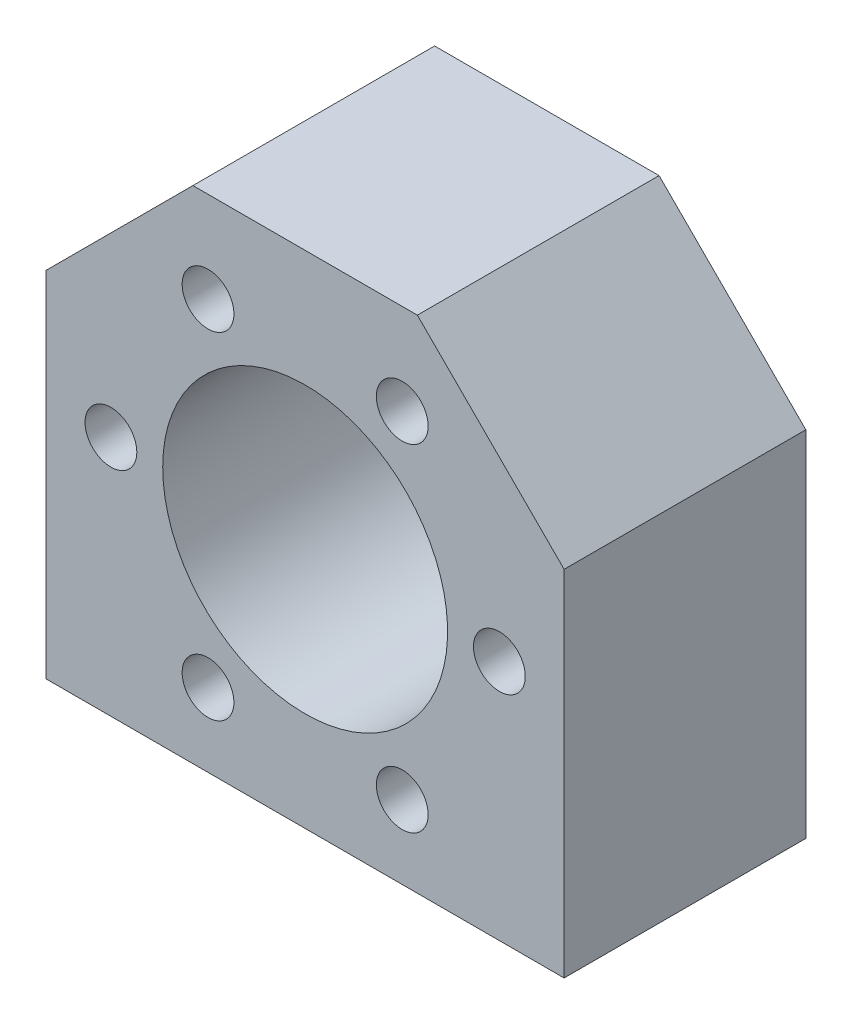
ISO-10303-21;
HEADER;
FILE_DESCRIPTION(('STEP AP214'),'2;1');
FILE_NAME('part.step','',(''),(''),'','','');
FILE_SCHEMA(('AUTOMOTIVE_DESIGN { 1 0 10303 214 1 1 1 1 }'));
ENDSEC;
DATA;
#1=APPLICATION_CONTEXT('core data for automotive mechanical design processes');
#2=APPLICATION_PROTOCOL_DEFINITION('international standard','automotive_design',2000,#1);
#3=PRODUCT_CONTEXT('',#1,'mechanical');
#4=PRODUCT('Part','Part','',(#3));
#5=PRODUCT_RELATED_PRODUCT_CATEGORY('part','',(#4));
#6=PRODUCT_DEFINITION_FORMATION('','',#4);
#7=PRODUCT_DEFINITION_CONTEXT('part definition',#1,'design');
#8=PRODUCT_DEFINITION('design','',#6,#7);
#9=PRODUCT_DEFINITION_SHAPE('','',#8);
#10=(LENGTH_UNIT() NAMED_UNIT(*) SI_UNIT(.MILLI.,.METRE.));
#11=(NAMED_UNIT(*) PLANE_ANGLE_UNIT() SI_UNIT($,.RADIAN.));
#12=(NAMED_UNIT(*) SI_UNIT($,.STERADIAN.) SOLID_ANGLE_UNIT());
#13=UNCERTAINTY_MEASURE_WITH_UNIT(LENGTH_MEASURE(1.E-05),#10,'distance_accuracy_value','');
#14=(GEOMETRIC_REPRESENTATION_CONTEXT(3) GLOBAL_UNCERTAINTY_ASSIGNED_CONTEXT((#13)) GLOBAL_UNIT_ASSIGNED_CONTEXT((#10,
#11,#12)) REPRESENTATION_CONTEXT('',''));
#15=CARTESIAN_POINT('',(0.,0.,0.));
#16=DIRECTION('',(0.,0.,1.));
#17=DIRECTION('',(1.,0.,0.));
#18=AXIS2_PLACEMENT_3D('',#15,#16,#17);
#19=CARTESIAN_POINT('',(41.1066648374422,-36.4016686785176,28.));
#20=DIRECTION('',(0.,1.,0.));
#21=DIRECTION('',(0.,0.,1.));
#22=AXIS2_PLACEMENT_3D('',#19,#20,#21);
#23=PLANE('',#22);
#24=CARTESIAN_POINT('',(-10.8933351625578,-36.4016686785176,14.));
#25=DIRECTION('',(0.,-1.,0.));
#26=DIRECTION('',(0.,0.,-1.));
#27=AXIS2_PLACEMENT_3D('',#24,#25,#26);
#28=CIRCLE('',#27,4.);
#29=CARTESIAN_POINT('',(-10.8933351625578,-36.4016686785176,10.));
#30=VERTEX_POINT('',#29);
#31=EDGE_CURVE('E163',#30,#30,#28,.T.);
#32=ORIENTED_EDGE('',*,*,#31,.F.);
#33=EDGE_LOOP('',(#32));
#34=FACE_BOUND('',#33,.T.);
#35=CARTESIAN_POINT('',(33.1066648374422,-36.4016686785176,14.));
#36=DIRECTION('',(0.,-1.,0.));
#37=DIRECTION('',(0.,0.,-1.));
#38=AXIS2_PLACEMENT_3D('',#35,#36,#37);
#39=CIRCLE('',#38,4.00000000000001);
#40=CARTESIAN_POINT('',(33.1066648374422,-36.4016686785176,9.99999999999999));
#41=VERTEX_POINT('',#40);
#42=EDGE_CURVE('E166',#41,#41,#39,.T.);
#43=ORIENTED_EDGE('',*,*,#42,.F.);
#44=EDGE_LOOP('',(#43));
#45=FACE_BOUND('',#44,.T.);
#46=DIRECTION('',(1.,0.,0.));
#47=VECTOR('',#46,1.);
#48=CARTESIAN_POINT('',(41.1066648374422,-36.4016686785176,0.));
#49=LINE('',#48,#47);
#50=CARTESIAN_POINT('',(-18.8933351625578,-36.4016686785176,0.));
#51=VERTEX_POINT('',#50);
#52=CARTESIAN_POINT('',(41.1066648374422,-36.4016686785176,0.));
#53=VERTEX_POINT('',#52);
#54=EDGE_CURVE('E117',#51,#53,#49,.T.);
#55=ORIENTED_EDGE('',*,*,#54,.T.);
#56=DIRECTION('',(0.,0.,-1.));
#57=VECTOR('',#56,1.);
#58=CARTESIAN_POINT('',(41.1066648374422,-36.4016686785176,28.));
#59=LINE('',#58,#57);
#60=CARTESIAN_POINT('',(41.1066648374422,-36.4016686785176,28.));
#61=VERTEX_POINT('',#60);
#62=EDGE_CURVE('E11',#61,#53,#59,.T.);
#63=ORIENTED_EDGE('',*,*,#62,.F.);
#64=DIRECTION('',(1.,0.,0.));
#65=VECTOR('',#64,1.);
#66=CARTESIAN_POINT('',(41.1066648374422,-36.4016686785176,28.));
#67=LINE('',#66,#65);
#68=CARTESIAN_POINT('',(-18.8933351625578,-36.4016686785176,28.));
#69=VERTEX_POINT('',#68);
#70=EDGE_CURVE('E128',#69,#61,#67,.T.);
#71=ORIENTED_EDGE('',*,*,#70,.F.);
#72=DIRECTION('',(0.,0.,-1.));
#73=VECTOR('',#72,1.);
#74=CARTESIAN_POINT('',(-18.8933351625578,-36.4016686785176,28.));
#75=LINE('',#74,#73);
#76=EDGE_CURVE('E113',#69,#51,#75,.T.);
#77=ORIENTED_EDGE('',*,*,#76,.T.);
#78=EDGE_LOOP('',(#55,#63,#71,#77));
#79=FACE_BOUND('',#78,.T.);
#80=ADVANCED_FACE('F33',(#34,#45,#79),#23,.F.);
#81=CARTESIAN_POINT('',(41.1066648374422,4.59833132148261,28.));
#82=DIRECTION('',(-1.,0.,0.));
#83=DIRECTION('',(0.,0.,1.));
#84=AXIS2_PLACEMENT_3D('',#81,#82,#83);
#85=PLANE('',#84);
#86=DIRECTION('',(0.,1.,0.));
#87=VECTOR('',#86,1.);
#88=CARTESIAN_POINT('',(41.1066648374422,4.59833132148261,0.));
#89=LINE('',#88,#87);
#90=CARTESIAN_POINT('',(41.1066648374422,4.59833132148261,0.));
#91=VERTEX_POINT('',#90);
#92=EDGE_CURVE('E120',#53,#91,#89,.T.);
#93=ORIENTED_EDGE('',*,*,#92,.T.);
#94=DIRECTION('',(0.,0.,-1.));
#95=VECTOR('',#94,1.);
#96=CARTESIAN_POINT('',(41.1066648374422,4.59833132148261,28.));
#97=LINE('',#96,#95);
#98=CARTESIAN_POINT('',(41.1066648374422,4.59833132148261,28.));
#99=VERTEX_POINT('',#98);
#100=EDGE_CURVE('E41',#99,#91,#97,.T.);
#101=ORIENTED_EDGE('',*,*,#100,.F.);
#102=DIRECTION('',(0.,1.,0.));
#103=VECTOR('',#102,1.);
#104=CARTESIAN_POINT('',(41.1066648374422,4.59833132148261,28.));
#105=LINE('',#104,#103);
#106=EDGE_CURVE('E86',#61,#99,#105,.T.);
#107=ORIENTED_EDGE('',*,*,#106,.F.);
#108=ORIENTED_EDGE('',*,*,#62,.T.);
#109=EDGE_LOOP('',(#93,#101,#107,#108));
#110=FACE_BOUND('',#109,.T.);
#111=ADVANCED_FACE('F153',(#110),#85,.F.);
#112=CARTESIAN_POINT('',(24.1066648374422,21.5983313214826,28.));
#113=DIRECTION('',(-0.707106781186548,-0.707106781186547,0.));
#114=DIRECTION('',(0.707106781186547,-0.707106781186548,0.));
#115=AXIS2_PLACEMENT_3D('',#112,#113,#114);
#116=PLANE('',#115);
#117=DIRECTION('',(-0.707106781186547,0.707106781186548,0.));
#118=VECTOR('',#117,1.);
#119=CARTESIAN_POINT('',(24.1066648374422,21.5983313214826,0.));
#120=LINE('',#119,#118);
#121=CARTESIAN_POINT('',(24.1066648374422,21.5983313214826,0.));
#122=VERTEX_POINT('',#121);
#123=EDGE_CURVE('E123',#91,#122,#120,.T.);
#124=ORIENTED_EDGE('',*,*,#123,.T.);
#125=DIRECTION('',(0.,0.,-1.));
#126=VECTOR('',#125,1.);
#127=CARTESIAN_POINT('',(24.1066648374422,21.5983313214826,28.));
#128=LINE('',#127,#126);
#129=CARTESIAN_POINT('',(24.1066648374422,21.5983313214826,28.));
#130=VERTEX_POINT('',#129);
#131=EDGE_CURVE('E108',#130,#122,#128,.T.);
#132=ORIENTED_EDGE('',*,*,#131,.F.);
#133=DIRECTION('',(-0.707106781186547,0.707106781186548,0.));
#134=VECTOR('',#133,1.);
#135=CARTESIAN_POINT('',(24.1066648374422,21.5983313214826,28.));
#136=LINE('',#135,#134);
#137=EDGE_CURVE('E99',#99,#130,#136,.T.);
#138=ORIENTED_EDGE('',*,*,#137,.F.);
#139=ORIENTED_EDGE('',*,*,#100,.T.);
#140=EDGE_LOOP('',(#124,#132,#138,#139));
#141=FACE_BOUND('',#140,.T.);
#142=ADVANCED_FACE('F134',(#141),#116,.F.);
#143=CARTESIAN_POINT('',(-1.89333516255775,21.5983313214826,28.));
#144=DIRECTION('',(0.,-1.,0.));
#145=DIRECTION('',(0.,0.,-1.));
#146=AXIS2_PLACEMENT_3D('',#143,#144,#145);
#147=PLANE('',#146);
#148=DIRECTION('',(-1.,0.,0.));
#149=VECTOR('',#148,1.);
#150=CARTESIAN_POINT('',(-1.89333516255775,21.5983313214826,0.));
#151=LINE('',#150,#149);
#152=CARTESIAN_POINT('',(-1.89333516255775,21.5983313214826,0.));
#153=VERTEX_POINT('',#152);
#154=EDGE_CURVE('E107',#122,#153,#151,.T.);
#155=ORIENTED_EDGE('',*,*,#154,.T.);
#156=DIRECTION('',(0.,0.,-1.));
#157=VECTOR('',#156,1.);
#158=CARTESIAN_POINT('',(-1.89333516255775,21.5983313214826,28.));
#159=LINE('',#158,#157);
#160=CARTESIAN_POINT('',(-1.89333516255775,21.5983313214826,28.));
#161=VERTEX_POINT('',#160);
#162=EDGE_CURVE('E104',#161,#153,#159,.T.);
#163=ORIENTED_EDGE('',*,*,#162,.F.);
#164=DIRECTION('',(-1.,0.,0.));
#165=VECTOR('',#164,1.);
#166=CARTESIAN_POINT('',(-1.89333516255775,21.5983313214826,28.));
#167=LINE('',#166,#165);
#168=EDGE_CURVE('E93',#130,#161,#167,.T.);
#169=ORIENTED_EDGE('',*,*,#168,.F.);
#170=ORIENTED_EDGE('',*,*,#131,.T.);
#171=EDGE_LOOP('',(#155,#163,#169,#170));
#172=FACE_BOUND('',#171,.T.);
#173=ADVANCED_FACE('F105',(#172),#147,.F.);
#174=CARTESIAN_POINT('',(-18.8933351625578,4.59833132148261,28.));
#175=DIRECTION('',(0.707106781186547,-0.707106781186548,0.));
#176=DIRECTION('',(0.707106781186548,0.707106781186547,0.));
#177=AXIS2_PLACEMENT_3D('',#174,#175,#176);
#178=PLANE('',#177);
#179=DIRECTION('',(-0.707106781186548,-0.707106781186547,0.));
#180=VECTOR('',#179,1.);
#181=CARTESIAN_POINT('',(-18.8933351625578,4.59833132148261,0.));
#182=LINE('',#181,#180);
#183=CARTESIAN_POINT('',(-18.8933351625578,4.59833132148261,0.));
#184=VERTEX_POINT('',#183);
#185=EDGE_CURVE('E72',#153,#184,#182,.T.);
#186=ORIENTED_EDGE('',*,*,#185,.T.);
#187=DIRECTION('',(0.,0.,-1.));
#188=VECTOR('',#187,1.);
#189=CARTESIAN_POINT('',(-18.8933351625578,4.59833132148261,28.));
#190=LINE('',#189,#188);
#191=CARTESIAN_POINT('',(-18.8933351625578,4.59833132148261,28.));
#192=VERTEX_POINT('',#191);
#193=EDGE_CURVE('E109',#192,#184,#190,.T.);
#194=ORIENTED_EDGE('',*,*,#193,.F.);
#195=DIRECTION('',(-0.707106781186548,-0.707106781186547,0.));
#196=VECTOR('',#195,1.);
#197=CARTESIAN_POINT('',(-18.8933351625578,4.59833132148261,28.));
#198=LINE('',#197,#196);
#199=EDGE_CURVE('E97',#161,#192,#198,.T.);
#200=ORIENTED_EDGE('',*,*,#199,.F.);
#201=ORIENTED_EDGE('',*,*,#162,.T.);
#202=EDGE_LOOP('',(#186,#194,#200,#201));
#203=FACE_BOUND('',#202,.T.);
#204=ADVANCED_FACE('F111',(#203),#178,.F.);
#205=CARTESIAN_POINT('',(-18.8933351625578,-36.4016686785176,28.));
#206=DIRECTION('',(1.,0.,0.));
#207=DIRECTION('',(0.,0.,-1.));
#208=AXIS2_PLACEMENT_3D('',#205,#206,#207);
#209=PLANE('',#208);
#210=DIRECTION('',(0.,-1.,0.));
#211=VECTOR('',#210,1.);
#212=CARTESIAN_POINT('',(-18.8933351625578,-36.4016686785176,0.));
#213=LINE('',#212,#211);
#214=EDGE_CURVE('E78',#184,#51,#213,.T.);
#215=ORIENTED_EDGE('',*,*,#214,.T.);
#216=ORIENTED_EDGE('',*,*,#76,.F.);
#217=DIRECTION('',(0.,-1.,0.));
#218=VECTOR('',#217,1.);
#219=CARTESIAN_POINT('',(-18.8933351625578,-36.4016686785176,28.));
#220=LINE('',#219,#218);
#221=EDGE_CURVE('E49',#192,#69,#220,.T.);
#222=ORIENTED_EDGE('',*,*,#221,.F.);
#223=ORIENTED_EDGE('',*,*,#193,.T.);
#224=EDGE_LOOP('',(#215,#216,#222,#223));
#225=FACE_BOUND('',#224,.T.);
#226=ADVANCED_FACE('F141',(#225),#209,.F.);
#227=CARTESIAN_POINT('',(0.,0.,28.));
#228=DIRECTION('',(0.,0.,-1.));
#229=DIRECTION('',(-1.,0.,0.));
#230=AXIS2_PLACEMENT_3D('',#227,#228,#229);
#231=PLANE('',#230);
#232=CARTESIAN_POINT('',(22.3566648374424,-27.8872402636674,28.));
#233=DIRECTION('',(0.,0.,-1.));
#234=DIRECTION('',(-0.500000000000007,0.866025403784435,0.));
#235=AXIS2_PLACEMENT_3D('',#232,#233,#234);
#236=CIRCLE('',#235,3.);
#237=CARTESIAN_POINT('',(20.8566648374424,-25.2891640523141,28.));
#238=VERTEX_POINT('',#237);
#239=EDGE_CURVE('E193',#238,#238,#236,.T.);
#240=ORIENTED_EDGE('',*,*,#239,.T.);
#241=EDGE_LOOP('',(#240));
#242=FACE_BOUND('',#241,.T.);
#243=CARTESIAN_POINT('',(-0.143335162557646,-27.8872402636675,28.));
#244=DIRECTION('',(0.,0.,-1.));
#245=DIRECTION('',(0.499999999999994,0.866025403784442,0.));
#246=AXIS2_PLACEMENT_3D('',#243,#244,#245);
#247=CIRCLE('',#246,3.);
#248=CARTESIAN_POINT('',(1.35666483744234,-25.2891640523142,28.));
#249=VERTEX_POINT('',#248);
#250=EDGE_CURVE('E187',#249,#249,#247,.T.);
#251=ORIENTED_EDGE('',*,*,#250,.T.);
#252=EDGE_LOOP('',(#251));
#253=FACE_BOUND('',#252,.T.);
#254=CARTESIAN_POINT('',(-11.3933351625578,-8.4016686785177,28.));
#255=DIRECTION('',(0.,0.,-1.));
#256=DIRECTION('',(1.,0.,0.));
#257=AXIS2_PLACEMENT_3D('',#254,#255,#256);
#258=CIRCLE('',#257,3.);
#259=CARTESIAN_POINT('',(-8.39333516255777,-8.40166867851769,28.));
#260=VERTEX_POINT('',#259);
#261=EDGE_CURVE('E181',#260,#260,#258,.T.);
#262=ORIENTED_EDGE('',*,*,#261,.T.);
#263=EDGE_LOOP('',(#262));
#264=FACE_BOUND('',#263,.T.);
#265=CARTESIAN_POINT('',(-0.14333516255784,11.0839029066323,28.));
#266=DIRECTION('',(0.,0.,-1.));
#267=DIRECTION('',(0.500000000000003,-0.866025403784437,0.));
#268=AXIS2_PLACEMENT_3D('',#265,#266,#267);
#269=CIRCLE('',#268,3.);
#270=CARTESIAN_POINT('',(1.35666483744217,8.48582669527894,28.));
#271=VERTEX_POINT('',#270);
#272=EDGE_CURVE('E174',#271,#271,#269,.T.);
#273=ORIENTED_EDGE('',*,*,#272,.T.);
#274=EDGE_LOOP('',(#273));
#275=FACE_BOUND('',#274,.T.);
#276=CARTESIAN_POINT('',(22.3566648374422,11.0839029066323,28.));
#277=DIRECTION('',(0.,0.,-1.));
#278=DIRECTION('',(-0.499999999999999,-0.866025403784439,0.));
#279=AXIS2_PLACEMENT_3D('',#276,#277,#278);
#280=CIRCLE('',#279,3.);
#281=CARTESIAN_POINT('',(20.8566648374422,8.48582669527899,28.));
#282=VERTEX_POINT('',#281);
#283=EDGE_CURVE('E200',#282,#282,#280,.T.);
#284=ORIENTED_EDGE('',*,*,#283,.T.);
#285=EDGE_LOOP('',(#284));
#286=FACE_BOUND('',#285,.T.);
#287=CARTESIAN_POINT('',(33.6066648374422,-8.40166867851758,28.));
#288=DIRECTION('',(0.,0.,-1.));
#289=DIRECTION('',(-1.,0.,0.));
#290=AXIS2_PLACEMENT_3D('',#287,#288,#289);
#291=CIRCLE('',#290,3.);
#292=CARTESIAN_POINT('',(30.6066648374422,-8.40166867851758,28.));
#293=VERTEX_POINT('',#292);
#294=EDGE_CURVE('E206',#293,#293,#291,.T.);
#295=ORIENTED_EDGE('',*,*,#294,.T.);
#296=EDGE_LOOP('',(#295));
#297=FACE_BOUND('',#296,.T.);
#298=CARTESIAN_POINT('',(11.1066648374422,-8.40166867851758,28.));
#299=DIRECTION('',(0.,0.,-1.));
#300=DIRECTION('',(-1.,0.,0.));
#301=AXIS2_PLACEMENT_3D('',#298,#299,#300);
#302=CIRCLE('',#301,16.5);
#303=CARTESIAN_POINT('',(-5.39333516255777,-8.40166867851758,28.));
#304=VERTEX_POINT('',#303);
#305=EDGE_CURVE('E121',#304,#304,#302,.T.);
#306=ORIENTED_EDGE('',*,*,#305,.T.);
#307=EDGE_LOOP('',(#306));
#308=FACE_BOUND('',#307,.T.);
#309=ORIENTED_EDGE('',*,*,#70,.T.);
#310=ORIENTED_EDGE('',*,*,#106,.T.);
#311=ORIENTED_EDGE('',*,*,#137,.T.);
#312=ORIENTED_EDGE('',*,*,#168,.T.);
#313=ORIENTED_EDGE('',*,*,#199,.T.);
#314=ORIENTED_EDGE('',*,*,#221,.T.);
#315=EDGE_LOOP('',(#309,#310,#311,#312,#313,#314));
#316=FACE_BOUND('',#315,.T.);
#317=ADVANCED_FACE('F95',(#242,#253,#264,#275,#286,#297,#308,#316),#231,.F.);
#318=CARTESIAN_POINT('',(0.,0.,0.));
#319=DIRECTION('',(0.,0.,-1.));
#320=DIRECTION('',(-1.,0.,0.));
#321=AXIS2_PLACEMENT_3D('',#318,#319,#320);
#322=PLANE('',#321);
#323=CARTESIAN_POINT('',(22.3566648374424,-27.8872402636674,0.));
#324=DIRECTION('',(0.,0.,-1.));
#325=DIRECTION('',(-0.500000000000007,0.866025403784435,0.));
#326=AXIS2_PLACEMENT_3D('',#323,#324,#325);
#327=CIRCLE('',#326,3.);
#328=CARTESIAN_POINT('',(20.8566648374424,-25.2891640523141,0.));
#329=VERTEX_POINT('',#328);
#330=EDGE_CURVE('E196',#329,#329,#327,.T.);
#331=ORIENTED_EDGE('',*,*,#330,.F.);
#332=EDGE_LOOP('',(#331));
#333=FACE_BOUND('',#332,.T.);
#334=CARTESIAN_POINT('',(-0.143335162557646,-27.8872402636675,0.));
#335=DIRECTION('',(0.,0.,-1.));
#336=DIRECTION('',(0.499999999999994,0.866025403784442,0.));
#337=AXIS2_PLACEMENT_3D('',#334,#335,#336);
#338=CIRCLE('',#337,3.);
#339=CARTESIAN_POINT('',(1.35666483744234,-25.2891640523142,0.));
#340=VERTEX_POINT('',#339);
#341=EDGE_CURVE('E190',#340,#340,#338,.T.);
#342=ORIENTED_EDGE('',*,*,#341,.F.);
#343=EDGE_LOOP('',(#342));
#344=FACE_BOUND('',#343,.T.);
#345=CARTESIAN_POINT('',(-11.3933351625578,-8.4016686785177,0.));
#346=DIRECTION('',(0.,0.,-1.));
#347=DIRECTION('',(1.,0.,0.));
#348=AXIS2_PLACEMENT_3D('',#345,#346,#347);
#349=CIRCLE('',#348,3.);
#350=CARTESIAN_POINT('',(-8.39333516255777,-8.40166867851769,0.));
#351=VERTEX_POINT('',#350);
#352=EDGE_CURVE('E184',#351,#351,#349,.T.);
#353=ORIENTED_EDGE('',*,*,#352,.F.);
#354=EDGE_LOOP('',(#353));
#355=FACE_BOUND('',#354,.T.);
#356=CARTESIAN_POINT('',(-0.14333516255784,11.0839029066323,0.));
#357=DIRECTION('',(0.,0.,-1.));
#358=DIRECTION('',(0.500000000000003,-0.866025403784437,0.));
#359=AXIS2_PLACEMENT_3D('',#356,#357,#358);
#360=CIRCLE('',#359,3.);
#361=CARTESIAN_POINT('',(1.35666483744217,8.48582669527894,0.));
#362=VERTEX_POINT('',#361);
#363=EDGE_CURVE('E178',#362,#362,#360,.T.);
#364=ORIENTED_EDGE('',*,*,#363,.F.);
#365=EDGE_LOOP('',(#364));
#366=FACE_BOUND('',#365,.T.);
#367=CARTESIAN_POINT('',(22.3566648374422,11.0839029066323,0.));
#368=DIRECTION('',(0.,0.,-1.));
#369=DIRECTION('',(-0.499999999999999,-0.866025403784439,0.));
#370=AXIS2_PLACEMENT_3D('',#367,#368,#369);
#371=CIRCLE('',#370,3.);
#372=CARTESIAN_POINT('',(20.8566648374422,8.48582669527899,0.));
#373=VERTEX_POINT('',#372);
#374=EDGE_CURVE('E177',#373,#373,#371,.T.);
#375=ORIENTED_EDGE('',*,*,#374,.F.);
#376=EDGE_LOOP('',(#375));
#377=FACE_BOUND('',#376,.T.);
#378=CARTESIAN_POINT('',(33.6066648374422,-8.40166867851758,0.));
#379=DIRECTION('',(0.,0.,-1.));
#380=DIRECTION('',(-1.,0.,0.));
#381=AXIS2_PLACEMENT_3D('',#378,#379,#380);
#382=CIRCLE('',#381,3.);
#383=CARTESIAN_POINT('',(30.6066648374422,-8.40166867851758,0.));
#384=VERTEX_POINT('',#383);
#385=EDGE_CURVE('E203',#384,#384,#382,.T.);
#386=ORIENTED_EDGE('',*,*,#385,.F.);
#387=EDGE_LOOP('',(#386));
#388=FACE_BOUND('',#387,.T.);
#389=CARTESIAN_POINT('',(11.1066648374422,-8.40166867851758,0.));
#390=DIRECTION('',(0.,0.,-1.));
#391=DIRECTION('',(-1.,0.,0.));
#392=AXIS2_PLACEMENT_3D('',#389,#390,#391);
#393=CIRCLE('',#392,16.5);
#394=CARTESIAN_POINT('',(-5.39333516255777,-8.40166867851758,0.));
#395=VERTEX_POINT('',#394);
#396=EDGE_CURVE('E209',#395,#395,#393,.T.);
#397=ORIENTED_EDGE('',*,*,#396,.F.);
#398=EDGE_LOOP('',(#397));
#399=FACE_BOUND('',#398,.T.);
#400=ORIENTED_EDGE('',*,*,#54,.F.);
#401=ORIENTED_EDGE('',*,*,#214,.F.);
#402=ORIENTED_EDGE('',*,*,#185,.F.);
#403=ORIENTED_EDGE('',*,*,#154,.F.);
#404=ORIENTED_EDGE('',*,*,#123,.F.);
#405=ORIENTED_EDGE('',*,*,#92,.F.);
#406=EDGE_LOOP('',(#400,#401,#402,#403,#404,#405));
#407=FACE_BOUND('',#406,.T.);
#408=ADVANCED_FACE('F137',(#333,#344,#355,#366,#377,#388,#399,#407),#322,.T.);
#409=CARTESIAN_POINT('',(11.1066648374422,-8.40166867851758,28.));
#410=DIRECTION('',(0.,0.,-1.));
#411=DIRECTION('',(-1.,0.,0.));
#412=AXIS2_PLACEMENT_3D('',#409,#410,#411);
#413=CYLINDRICAL_SURFACE('',#412,16.5);
#414=ORIENTED_EDGE('',*,*,#305,.F.);
#415=EDGE_LOOP('',(#414));
#416=FACE_BOUND('',#415,.T.);
#417=ORIENTED_EDGE('',*,*,#396,.T.);
#418=EDGE_LOOP('',(#417));
#419=FACE_BOUND('',#418,.T.);
#420=ADVANCED_FACE('F219',(#416,#419),#413,.F.);
#421=CARTESIAN_POINT('',(33.6066648374422,-8.40166867851758,28.));
#422=DIRECTION('',(0.,0.,-1.));
#423=DIRECTION('',(-1.,0.,0.));
#424=AXIS2_PLACEMENT_3D('',#421,#422,#423);
#425=CYLINDRICAL_SURFACE('',#424,3.);
#426=ORIENTED_EDGE('',*,*,#294,.F.);
#427=EDGE_LOOP('',(#426));
#428=FACE_BOUND('',#427,.T.);
#429=ORIENTED_EDGE('',*,*,#385,.T.);
#430=EDGE_LOOP('',(#429));
#431=FACE_BOUND('',#430,.T.);
#432=ADVANCED_FACE('F226',(#428,#431),#425,.F.);
#433=CARTESIAN_POINT('',(22.3566648374422,11.0839029066323,28.));
#434=DIRECTION('',(0.,0.,-1.));
#435=DIRECTION('',(-1.,0.,0.));
#436=AXIS2_PLACEMENT_3D('',#433,#434,#435);
#437=CYLINDRICAL_SURFACE('',#436,3.);
#438=ORIENTED_EDGE('',*,*,#283,.F.);
#439=EDGE_LOOP('',(#438));
#440=FACE_BOUND('',#439,.T.);
#441=ORIENTED_EDGE('',*,*,#374,.T.);
#442=EDGE_LOOP('',(#441));
#443=FACE_BOUND('',#442,.T.);
#444=ADVANCED_FACE('F234',(#440,#443),#437,.F.);
#445=CARTESIAN_POINT('',(-0.14333516255784,11.0839029066323,28.));
#446=DIRECTION('',(0.,0.,-1.));
#447=DIRECTION('',(-1.,0.,0.));
#448=AXIS2_PLACEMENT_3D('',#445,#446,#447);
#449=CYLINDRICAL_SURFACE('',#448,3.);
#450=ORIENTED_EDGE('',*,*,#272,.F.);
#451=EDGE_LOOP('',(#450));
#452=FACE_BOUND('',#451,.T.);
#453=ORIENTED_EDGE('',*,*,#363,.T.);
#454=EDGE_LOOP('',(#453));
#455=FACE_BOUND('',#454,.T.);
#456=ADVANCED_FACE('F238',(#452,#455),#449,.F.);
#457=CARTESIAN_POINT('',(-11.3933351625578,-8.4016686785177,28.));
#458=DIRECTION('',(0.,0.,-1.));
#459=DIRECTION('',(-1.,0.,0.));
#460=AXIS2_PLACEMENT_3D('',#457,#458,#459);
#461=CYLINDRICAL_SURFACE('',#460,3.);
#462=ORIENTED_EDGE('',*,*,#261,.F.);
#463=EDGE_LOOP('',(#462));
#464=FACE_BOUND('',#463,.T.);
#465=ORIENTED_EDGE('',*,*,#352,.T.);
#466=EDGE_LOOP('',(#465));
#467=FACE_BOUND('',#466,.T.);
#468=ADVANCED_FACE('F248',(#464,#467),#461,.F.);
#469=CARTESIAN_POINT('',(-0.143335162557646,-27.8872402636675,28.));
#470=DIRECTION('',(0.,0.,-1.));
#471=DIRECTION('',(-1.,0.,0.));
#472=AXIS2_PLACEMENT_3D('',#469,#470,#471);
#473=CYLINDRICAL_SURFACE('',#472,3.);
#474=ORIENTED_EDGE('',*,*,#250,.F.);
#475=EDGE_LOOP('',(#474));
#476=FACE_BOUND('',#475,.T.);
#477=ORIENTED_EDGE('',*,*,#341,.T.);
#478=EDGE_LOOP('',(#477));
#479=FACE_BOUND('',#478,.T.);
#480=ADVANCED_FACE('F244',(#476,#479),#473,.F.);
#481=CARTESIAN_POINT('',(22.3566648374424,-27.8872402636674,28.));
#482=DIRECTION('',(0.,0.,-1.));
#483=DIRECTION('',(-1.,0.,0.));
#484=AXIS2_PLACEMENT_3D('',#481,#482,#483);
#485=CYLINDRICAL_SURFACE('',#484,3.);
#486=ORIENTED_EDGE('',*,*,#239,.F.);
#487=EDGE_LOOP('',(#486));
#488=FACE_BOUND('',#487,.T.);
#489=ORIENTED_EDGE('',*,*,#330,.T.);
#490=EDGE_LOOP('',(#489));
#491=FACE_BOUND('',#490,.T.);
#492=ADVANCED_FACE('F240',(#488,#491),#485,.F.);
#493=CARTESIAN_POINT('',(33.1066648374422,-16.4016686785176,14.));
#494=DIRECTION('',(0.,-1.,0.));
#495=DIRECTION('',(0.,0.,-1.));
#496=AXIS2_PLACEMENT_3D('',#493,#494,#495);
#497=CYLINDRICAL_SURFACE('',#496,4.00000000000001);
#498=CARTESIAN_POINT('',(33.1066648374422,-16.4016686785176,14.));
#499=DIRECTION('',(0.,-1.,0.));
#500=DIRECTION('',(0.,0.,-1.));
#501=AXIS2_PLACEMENT_3D('',#498,#499,#500);
#502=CIRCLE('',#501,4.00000000000001);
#503=CARTESIAN_POINT('',(33.1066648374422,-16.4016686785176,9.99999999999999));
#504=VERTEX_POINT('',#503);
#505=EDGE_CURVE('E168',#504,#504,#502,.T.);
#506=ORIENTED_EDGE('',*,*,#505,.F.);
#507=EDGE_LOOP('',(#506));
#508=FACE_BOUND('',#507,.T.);
#509=ORIENTED_EDGE('',*,*,#42,.T.);
#510=EDGE_LOOP('',(#509));
#511=FACE_BOUND('',#510,.T.);
#512=ADVANCED_FACE('F243',(#508,#511),#497,.F.);
#513=CARTESIAN_POINT('',(33.1066648374422,-16.4016686785176,14.));
#514=DIRECTION('',(0.,-1.,0.));
#515=DIRECTION('',(0.,0.,-1.));
#516=AXIS2_PLACEMENT_3D('',#513,#514,#515);
#517=PLANE('',#516);
#518=ORIENTED_EDGE('',*,*,#505,.T.);
#519=EDGE_LOOP('',(#518));
#520=FACE_BOUND('',#519,.T.);
#521=ADVANCED_FACE('F258',(#520),#517,.T.);
#522=CARTESIAN_POINT('',(-10.8933351625578,-16.4016686785176,14.));
#523=DIRECTION('',(0.,-1.,0.));
#524=DIRECTION('',(0.,0.,-1.));
#525=AXIS2_PLACEMENT_3D('',#522,#523,#524);
#526=CYLINDRICAL_SURFACE('',#525,4.);
#527=CARTESIAN_POINT('',(-10.8933351625578,-16.4016686785176,14.));
#528=DIRECTION('',(0.,-1.,0.));
#529=DIRECTION('',(0.,0.,-1.));
#530=AXIS2_PLACEMENT_3D('',#527,#528,#529);
#531=CIRCLE('',#530,4.);
#532=CARTESIAN_POINT('',(-10.8933351625578,-16.4016686785176,10.));
#533=VERTEX_POINT('',#532);
#534=EDGE_CURVE('E199',#533,#533,#531,.T.);
#535=ORIENTED_EDGE('',*,*,#534,.F.);
#536=EDGE_LOOP('',(#535));
#537=FACE_BOUND('',#536,.T.);
#538=ORIENTED_EDGE('',*,*,#31,.T.);
#539=EDGE_LOOP('',(#538));
#540=FACE_BOUND('',#539,.T.);
#541=ADVANCED_FACE('F262',(#537,#540),#526,.F.);
#542=CARTESIAN_POINT('',(-10.8933351625578,-16.4016686785176,14.));
#543=DIRECTION('',(0.,-1.,0.));
#544=DIRECTION('',(0.,0.,-1.));
#545=AXIS2_PLACEMENT_3D('',#542,#543,#544);
#546=PLANE('',#545);
#547=ORIENTED_EDGE('',*,*,#534,.T.);
#548=EDGE_LOOP('',(#547));
#549=FACE_BOUND('',#548,.T.);
#550=ADVANCED_FACE('F266',(#549),#546,.T.);
#551=CLOSED_SHELL('',(#80,#111,#142,#173,#204,#226,#317,#408,#420,#432,#444,#456,#468,#480,#492,
#512,#521,#541,#550));
#552=MANIFOLD_SOLID_BREP('B2',#551);
#553=ADVANCED_BREP_SHAPE_REPRESENTATION('',(#18,#552),#14);
#554=SHAPE_DEFINITION_REPRESENTATION(#9,#553);
ENDSEC;
END-ISO-10303-21;
